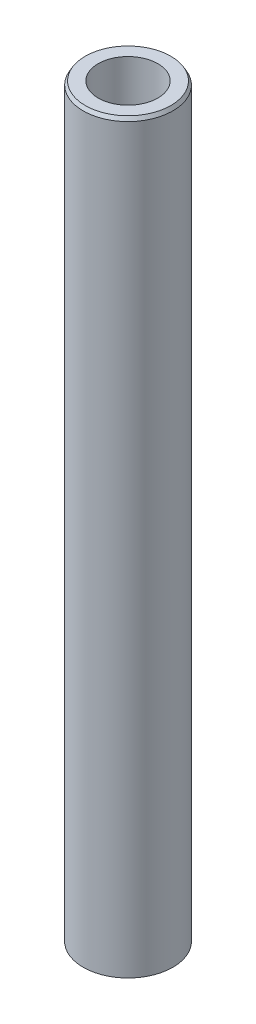
ISO-10303-21;
HEADER;
FILE_DESCRIPTION(('STEP AP214'),'2;1');
FILE_NAME('part.step','',(''),(''),'','','');
FILE_SCHEMA(('AUTOMOTIVE_DESIGN { 1 0 10303 214 1 1 1 1 }'));
ENDSEC;
DATA;
#1=APPLICATION_CONTEXT('core data for automotive mechanical design processes');
#2=APPLICATION_PROTOCOL_DEFINITION('international standard','automotive_design',2000,#1);
#3=PRODUCT_CONTEXT('',#1,'mechanical');
#4=PRODUCT('Part','Part','',(#3));
#5=PRODUCT_RELATED_PRODUCT_CATEGORY('part','',(#4));
#6=PRODUCT_DEFINITION_FORMATION('','',#4);
#7=PRODUCT_DEFINITION_CONTEXT('part definition',#1,'design');
#8=PRODUCT_DEFINITION('design','',#6,#7);
#9=PRODUCT_DEFINITION_SHAPE('','',#8);
#10=(LENGTH_UNIT() NAMED_UNIT(*) SI_UNIT(.MILLI.,.METRE.));
#11=(NAMED_UNIT(*) PLANE_ANGLE_UNIT() SI_UNIT($,.RADIAN.));
#12=(NAMED_UNIT(*) SI_UNIT($,.STERADIAN.) SOLID_ANGLE_UNIT());
#13=UNCERTAINTY_MEASURE_WITH_UNIT(LENGTH_MEASURE(1.E-05),#10,'distance_accuracy_value','');
#14=(GEOMETRIC_REPRESENTATION_CONTEXT(3) GLOBAL_UNCERTAINTY_ASSIGNED_CONTEXT((#13)) GLOBAL_UNIT_ASSIGNED_CONTEXT((#10,
#11,#12)) REPRESENTATION_CONTEXT('',''));
#15=CARTESIAN_POINT('',(0.,0.,0.));
#16=DIRECTION('',(0.,0.,1.));
#17=DIRECTION('',(1.,0.,0.));
#18=AXIS2_PLACEMENT_3D('',#15,#16,#17);
#19=CARTESIAN_POINT('',(0.,499.981358572789,0.));
#20=DIRECTION('',(0.,-1.,0.));
#21=DIRECTION('',(0.,0.,-1.));
#22=AXIS2_PLACEMENT_3D('',#19,#20,#21);
#23=CYLINDRICAL_SURFACE('',#22,30.);
#24=CARTESIAN_POINT('',(0.,497.579931080547,0.));
#25=DIRECTION('',(0.,1.,0.));
#26=DIRECTION('',(0.,0.,1.));
#27=AXIS2_PLACEMENT_3D('',#24,#25,#26);
#28=CIRCLE('',#27,30.);
#29=CARTESIAN_POINT('',(0.,497.579931080547,-30.));
#30=VERTEX_POINT('',#29);
#31=EDGE_CURVE('E50',#30,#30,#28,.F.);
#32=CARTESIAN_POINT('',(0.,1.38646480908561,0.));
#33=DIRECTION('',(0.,1.,0.));
#34=DIRECTION('',(0.,0.,1.));
#35=AXIS2_PLACEMENT_3D('',#32,#33,#34);
#36=CIRCLE('',#35,30.);
#37=CARTESIAN_POINT('',(0.,1.38646480908561,-30.));
#38=VERTEX_POINT('',#37);
#39=EDGE_CURVE('E51',#38,#38,#36,.T.);
#40=CARTESIAN_POINT('',(0.,497.579931080547,-30.));
#41=CARTESIAN_POINT('',(0.,492.411249140219,-30.));
#42=CARTESIAN_POINT('',(0.,487.242567199891,-30.));
#43=CARTESIAN_POINT('',(0.,476.905203319236,-30.));
#44=CARTESIAN_POINT('',(0.,471.736521378908,-30.));
#45=CARTESIAN_POINT('',(0.,461.399157498253,-30.));
#46=CARTESIAN_POINT('',(0.,456.230475557925,-30.));
#47=CARTESIAN_POINT('',(0.,445.89311167727,-30.));
#48=CARTESIAN_POINT('',(0.,440.724429736942,-30.));
#49=CARTESIAN_POINT('',(0.,430.387065856287,-30.));
#50=CARTESIAN_POINT('',(0.,425.218383915959,-30.));
#51=CARTESIAN_POINT('',(0.,414.881020035303,-30.));
#52=CARTESIAN_POINT('',(0.,409.712338094976,-30.));
#53=CARTESIAN_POINT('',(0.,399.37497421432,-30.));
#54=CARTESIAN_POINT('',(0.,394.206292273993,-30.));
#55=CARTESIAN_POINT('',(0.,383.868928393337,-30.));
#56=CARTESIAN_POINT('',(0.,378.700246453009,-30.));
#57=CARTESIAN_POINT('',(0.,368.362882572354,-30.));
#58=CARTESIAN_POINT('',(0.,363.194200632026,-30.));
#59=CARTESIAN_POINT('',(0.,352.856836751371,-30.));
#60=CARTESIAN_POINT('',(0.,347.688154811043,-30.));
#61=CARTESIAN_POINT('',(0.,337.350790930388,-30.));
#62=CARTESIAN_POINT('',(0.,332.18210899006,-30.));
#63=CARTESIAN_POINT('',(0.,321.844745109404,-30.));
#64=CARTESIAN_POINT('',(0.,316.676063169077,-30.));
#65=CARTESIAN_POINT('',(0.,306.338699288421,-30.));
#66=CARTESIAN_POINT('',(0.,301.170017348093,-30.));
#67=CARTESIAN_POINT('',(0.,290.832653467438,-30.));
#68=CARTESIAN_POINT('',(0.,285.66397152711,-30.));
#69=CARTESIAN_POINT('',(0.,275.326607646455,-30.));
#70=CARTESIAN_POINT('',(0.,270.157925706127,-30.));
#71=CARTESIAN_POINT('',(0.,259.820561825472,-30.));
#72=CARTESIAN_POINT('',(0.,254.651879885144,-30.));
#73=CARTESIAN_POINT('',(0.,244.314516004489,-30.));
#74=CARTESIAN_POINT('',(0.,239.145834064161,-30.));
#75=CARTESIAN_POINT('',(0.,228.808470183505,-30.));
#76=CARTESIAN_POINT('',(0.,223.639788243178,-30.));
#77=CARTESIAN_POINT('',(0.,213.302424362522,-30.));
#78=CARTESIAN_POINT('',(0.,208.133742422195,-30.));
#79=CARTESIAN_POINT('',(0.,197.796378541539,-30.));
#80=CARTESIAN_POINT('',(0.,192.627696601211,-30.));
#81=CARTESIAN_POINT('',(0.,182.290332720556,-30.));
#82=CARTESIAN_POINT('',(0.,177.121650780228,-30.));
#83=CARTESIAN_POINT('',(0.,166.784286899573,-30.));
#84=CARTESIAN_POINT('',(0.,161.615604959245,-30.));
#85=CARTESIAN_POINT('',(0.,151.27824107859,-30.));
#86=CARTESIAN_POINT('',(0.,146.109559138262,-30.));
#87=CARTESIAN_POINT('',(0.,135.772195257606,-30.));
#88=CARTESIAN_POINT('',(0.,130.603513317279,-30.));
#89=CARTESIAN_POINT('',(0.,120.266149436623,-30.));
#90=CARTESIAN_POINT('',(0.,115.097467496296,-30.));
#91=CARTESIAN_POINT('',(0.,104.76010361564,-30.));
#92=CARTESIAN_POINT('',(0.,99.5914216753123,-30.));
#93=CARTESIAN_POINT('',(0.,89.2540577946569,-30.));
#94=CARTESIAN_POINT('',(0.,84.0853758543292,-30.));
#95=CARTESIAN_POINT('',(0.,73.7480119736737,-30.));
#96=CARTESIAN_POINT('',(0.,68.579330033346,-30.));
#97=CARTESIAN_POINT('',(0.,58.2419661526906,-30.));
#98=CARTESIAN_POINT('',(0.,53.0732842123629,-30.));
#99=CARTESIAN_POINT('',(0.,42.7359203317074,-30.));
#100=CARTESIAN_POINT('',(0.,37.5672383913797,-30.));
#101=CARTESIAN_POINT('',(0.,27.2298745107242,-30.));
#102=CARTESIAN_POINT('',(0.,22.0611925703965,-30.));
#103=CARTESIAN_POINT('',(0.,11.7238286897411,-30.));
#104=CARTESIAN_POINT('',(0.,6.55514674941333,-30.));
#105=CARTESIAN_POINT('',(0.,1.38646480908561,-30.));
#106=B_SPLINE_CURVE_WITH_KNOTS('',3,(#40,#41,#42,#43,#44,#45,#46,#47,#48,#49,#50,#51,#52,#53,
#54,#55,#56,#57,#58,#59,#60,#61,#62,#63,#64,#65,#66,#67,#68,#69,#70,#71,#72,#73,#74,#75,#76,#77,
#78,#79,#80,#81,#82,#83,#84,#85,#86,#87,#88,#89,#90,#91,#92,#93,#94,#95,#96,#97,#98,#99,#100,
#101,#102,#103,#104,#105),.UNSPECIFIED.,.F.,.F.,(4,2,2,2,2,2,2,2,2,2,2,2,2,2,2,2,2,2,2,2,2,2,2,
2,2,2,2,2,2,2,2,2,4),(0.,15.5060458209831,31.0120916419663,46.5181374629495,62.0241832839326,
77.5302291049158,93.036274925899,108.542320746882,124.048366567865,139.554412388848,
155.060458209832,170.566504030815,186.072549851798,201.578595672781,217.084641493764,
232.590687314747,248.096733135731,263.602778956714,279.108824777697,294.61487059868,
310.120916419663,325.626962240646,341.13300806163,356.639053882613,372.145099703596,
387.651145524579,403.157191345562,418.663237166545,434.169282987529,449.675328808512,
465.181374629495,480.687420450478,496.193466271461),.UNSPECIFIED.);
#107=EDGE_CURVE('BSEAM39',#30,#38,#106,.T.);
#108=ORIENTED_EDGE('',*,*,#31,.T.);
#109=ORIENTED_EDGE('',*,*,#39,.T.);
#110=ORIENTED_EDGE('',*,*,#107,.T.);
#111=ORIENTED_EDGE('',*,*,#107,.F.);
#112=EDGE_LOOP('',(#108,#110,#109,#111));
#113=FACE_BOUND('',#112,.T.);
#114=ADVANCED_FACE('F39',(#113),#23,.T.);
#115=CARTESIAN_POINT('',(0.,499.981358572789,0.));
#116=DIRECTION('',(0.,1.,0.));
#117=DIRECTION('',(0.,0.,1.));
#118=AXIS2_PLACEMENT_3D('',#115,#116,#117);
#119=PLANE('',#118);
#120=CARTESIAN_POINT('',(0.,499.981358572789,0.));
#121=DIRECTION('',(0.,1.,0.));
#122=DIRECTION('',(0.,0.,1.));
#123=AXIS2_PLACEMENT_3D('',#120,#121,#122);
#124=CIRCLE('',#123,28.6135351909147);
#125=CARTESIAN_POINT('',(0.,499.981358572789,28.6135351909147));
#126=VERTEX_POINT('',#125);
#127=EDGE_CURVE('E54',#126,#126,#124,.T.);
#128=ORIENTED_EDGE('',*,*,#127,.T.);
#129=EDGE_LOOP('',(#128));
#130=FACE_BOUND('',#129,.T.);
#131=CARTESIAN_POINT('',(0.,499.981358572789,0.));
#132=DIRECTION('',(0.,1.,0.));
#133=DIRECTION('',(0.,0.,1.));
#134=AXIS2_PLACEMENT_3D('',#131,#132,#133);
#135=CIRCLE('',#134,19.9570828072295);
#136=CARTESIAN_POINT('',(0.,499.981358572789,-19.9570828072295));
#137=VERTEX_POINT('',#136);
#138=EDGE_CURVE('E58',#137,#137,#135,.T.);
#139=ORIENTED_EDGE('',*,*,#138,.F.);
#140=EDGE_LOOP('',(#139));
#141=FACE_BOUND('',#140,.T.);
#142=ADVANCED_FACE('F69',(#130,#141),#119,.T.);
#143=CARTESIAN_POINT('',(0.,0.,0.));
#144=DIRECTION('',(0.,1.,0.));
#145=DIRECTION('',(0.,0.,1.));
#146=AXIS2_PLACEMENT_3D('',#143,#144,#145);
#147=PLANE('',#146);
#148=CARTESIAN_POINT('',(0.,0.,0.));
#149=DIRECTION('',(0.,1.,0.));
#150=DIRECTION('',(0.,0.,1.));
#151=AXIS2_PLACEMENT_3D('',#148,#149,#150);
#152=CIRCLE('',#151,27.5985725077575);
#153=CARTESIAN_POINT('',(0.,0.,27.5985725077575));
#154=VERTEX_POINT('',#153);
#155=EDGE_CURVE('E10',#154,#154,#152,.F.);
#156=ORIENTED_EDGE('',*,*,#155,.T.);
#157=EDGE_LOOP('',(#156));
#158=FACE_BOUND('',#157,.T.);
#159=CARTESIAN_POINT('',(0.,0.,0.));
#160=DIRECTION('',(0.,1.,0.));
#161=DIRECTION('',(0.,0.,1.));
#162=AXIS2_PLACEMENT_3D('',#159,#160,#161);
#163=CIRCLE('',#162,19.9570828072295);
#164=CARTESIAN_POINT('',(0.,0.,-19.9570828072295));
#165=VERTEX_POINT('',#164);
#166=EDGE_CURVE('E63',#165,#165,#163,.T.);
#167=ORIENTED_EDGE('',*,*,#166,.T.);
#168=EDGE_LOOP('',(#167));
#169=FACE_BOUND('',#168,.T.);
#170=ADVANCED_FACE('F75',(#158,#169),#147,.F.);
#171=CARTESIAN_POINT('',(0.,499.981358572789,0.));
#172=DIRECTION('',(0.,-1.,0.));
#173=DIRECTION('',(0.,0.,-1.));
#174=AXIS2_PLACEMENT_3D('',#171,#172,#173);
#175=CYLINDRICAL_SURFACE('',#174,19.9570828072295);
#176=CARTESIAN_POINT('',(0.,499.981358572789,-19.9570828072295));
#177=CARTESIAN_POINT('',(0.,494.773219420989,-19.9570828072295));
#178=CARTESIAN_POINT('',(0.,489.565080269189,-19.9570828072295));
#179=CARTESIAN_POINT('',(0.,479.148801965589,-19.9570828072295));
#180=CARTESIAN_POINT('',(0.,473.94066281379,-19.9570828072295));
#181=CARTESIAN_POINT('',(0.,463.52438451019,-19.9570828072295));
#182=CARTESIAN_POINT('',(0.,458.31624535839,-19.9570828072295));
#183=CARTESIAN_POINT('',(0.,447.89996705479,-19.9570828072295));
#184=CARTESIAN_POINT('',(0.,442.69182790299,-19.9570828072295));
#185=CARTESIAN_POINT('',(0.,432.27554959939,-19.9570828072295));
#186=CARTESIAN_POINT('',(0.,427.06741044759,-19.9570828072295));
#187=CARTESIAN_POINT('',(0.,416.651132143991,-19.9570828072295));
#188=CARTESIAN_POINT('',(0.,411.442992992191,-19.9570828072295));
#189=CARTESIAN_POINT('',(0.,401.026714688591,-19.9570828072295));
#190=CARTESIAN_POINT('',(0.,395.818575536791,-19.9570828072295));
#191=CARTESIAN_POINT('',(0.,385.402297233191,-19.9570828072295));
#192=CARTESIAN_POINT('',(0.,380.194158081392,-19.9570828072295));
#193=CARTESIAN_POINT('',(0.,369.777879777792,-19.9570828072295));
#194=CARTESIAN_POINT('',(0.,364.569740625992,-19.9570828072295));
#195=CARTESIAN_POINT('',(0.,354.153462322392,-19.9570828072295));
#196=CARTESIAN_POINT('',(0.,348.945323170592,-19.9570828072295));
#197=CARTESIAN_POINT('',(0.,338.529044866992,-19.9570828072295));
#198=CARTESIAN_POINT('',(0.,333.320905715193,-19.9570828072295));
#199=CARTESIAN_POINT('',(0.,322.904627411593,-19.9570828072295));
#200=CARTESIAN_POINT('',(0.,317.696488259793,-19.9570828072295));
#201=CARTESIAN_POINT('',(0.,307.280209956193,-19.9570828072295));
#202=CARTESIAN_POINT('',(0.,302.072070804393,-19.9570828072295));
#203=CARTESIAN_POINT('',(0.,291.655792500793,-19.9570828072295));
#204=CARTESIAN_POINT('',(0.,286.447653348994,-19.9570828072295));
#205=CARTESIAN_POINT('',(0.,276.031375045394,-19.9570828072295));
#206=CARTESIAN_POINT('',(0.,270.823235893594,-19.9570828072295));
#207=CARTESIAN_POINT('',(0.,260.406957589994,-19.9570828072295));
#208=CARTESIAN_POINT('',(0.,255.198818438194,-19.9570828072295));
#209=CARTESIAN_POINT('',(0.,244.782540134595,-19.9570828072295));
#210=CARTESIAN_POINT('',(0.,239.574400982795,-19.9570828072295));
#211=CARTESIAN_POINT('',(0.,229.158122679195,-19.9570828072295));
#212=CARTESIAN_POINT('',(0.,223.949983527395,-19.9570828072295));
#213=CARTESIAN_POINT('',(0.,213.533705223795,-19.9570828072295));
#214=CARTESIAN_POINT('',(0.,208.325566071995,-19.9570828072295));
#215=CARTESIAN_POINT('',(0.,197.909287768396,-19.9570828072295));
#216=CARTESIAN_POINT('',(0.,192.701148616596,-19.9570828072295));
#217=CARTESIAN_POINT('',(0.,182.284870312996,-19.9570828072295));
#218=CARTESIAN_POINT('',(0.,177.076731161196,-19.9570828072295));
#219=CARTESIAN_POINT('',(0.,166.660452857596,-19.9570828072295));
#220=CARTESIAN_POINT('',(0.,161.452313705796,-19.9570828072295));
#221=CARTESIAN_POINT('',(0.,151.036035402197,-19.9570828072295));
#222=CARTESIAN_POINT('',(0.,145.827896250397,-19.9570828072295));
#223=CARTESIAN_POINT('',(0.,135.411617946797,-19.9570828072295));
#224=CARTESIAN_POINT('',(0.,130.203478794997,-19.9570828072295));
#225=CARTESIAN_POINT('',(0.,119.787200491397,-19.9570828072295));
#226=CARTESIAN_POINT('',(0.,114.579061339597,-19.9570828072295));
#227=CARTESIAN_POINT('',(0.,104.162783035998,-19.9570828072295));
#228=CARTESIAN_POINT('',(0.,98.9546438841978,-19.9570828072295));
#229=CARTESIAN_POINT('',(0.,88.538365580598,-19.9570828072295));
#230=CARTESIAN_POINT('',(0.,83.3302264287981,-19.9570828072295));
#231=CARTESIAN_POINT('',(0.,72.9139481251983,-19.9570828072295));
#232=CARTESIAN_POINT('',(0.,67.7058089733984,-19.9570828072295));
#233=CARTESIAN_POINT('',(0.,57.2895306697987,-19.9570828072295));
#234=CARTESIAN_POINT('',(0.,52.0813915179988,-19.9570828072295));
#235=CARTESIAN_POINT('',(0.,41.665113214399,-19.9570828072295));
#236=CARTESIAN_POINT('',(0.,36.4569740625992,-19.9570828072295));
#237=CARTESIAN_POINT('',(0.,26.0406957589994,-19.9570828072295));
#238=CARTESIAN_POINT('',(0.,20.8325566071995,-19.9570828072295));
#239=CARTESIAN_POINT('',(0.,10.4162783035997,-19.9570828072295));
#240=CARTESIAN_POINT('',(0.,5.20813915179983,-19.9570828072295));
#241=CARTESIAN_POINT('',(0.,0.,-19.9570828072295));
#242=B_SPLINE_CURVE_WITH_KNOTS('',3,(#176,#177,#178,#179,#180,#181,#182,#183,#184,#185,#186,
#187,#188,#189,#190,#191,#192,#193,#194,#195,#196,#197,#198,#199,#200,#201,#202,#203,#204,#205,
#206,#207,#208,#209,#210,#211,#212,#213,#214,#215,#216,#217,#218,#219,#220,#221,#222,#223,#224,
#225,#226,#227,#228,#229,#230,#231,#232,#233,#234,#235,#236,#237,#238,#239,#240,#241),
.UNSPECIFIED.,.F.,.F.,(4,2,2,2,2,2,2,2,2,2,2,2,2,2,2,2,2,2,2,2,2,2,2,2,2,2,2,2,2,2,2,2,4),(0.,
15.6244174553996,31.2488349107993,46.8732523661989,62.4976698215986,78.1220872769983,
93.7465047323979,109.370922187798,124.995339643197,140.619757098597,156.244174553996,
171.868592009396,187.493009464796,203.117426920195,218.741844375595,234.366261830995,
249.990679286394,265.615096741794,281.239514197194,296.863931652593,312.488349107993,
328.112766563393,343.737184018792,359.361601474192,374.986018929592,390.610436384991,
406.234853840391,421.859271295791,437.48368875119,453.10810620659,468.73252366199,
484.356941117389,499.981358572789),.UNSPECIFIED.);
#243=EDGE_CURVE('BSEAM70',#137,#165,#242,.T.);
#244=ORIENTED_EDGE('',*,*,#138,.T.);
#245=ORIENTED_EDGE('',*,*,#166,.F.);
#246=ORIENTED_EDGE('',*,*,#243,.T.);
#247=ORIENTED_EDGE('',*,*,#243,.F.);
#248=EDGE_LOOP('',(#244,#246,#245,#247));
#249=FACE_BOUND('',#248,.T.);
#250=ADVANCED_FACE('F70',(#249),#175,.F.);
#251=CARTESIAN_POINT('',(0.,499.981358572789,0.));
#252=DIRECTION('',(0.,-1.,0.));
#253=DIRECTION('',(0.,0.,-1.));
#254=AXIS2_PLACEMENT_3D('',#251,#252,#253);
#255=CONICAL_SURFACE('',#254,28.6135351909147,0.523598775598301);
#256=ORIENTED_EDGE('',*,*,#31,.F.);
#257=EDGE_LOOP('',(#256));
#258=FACE_BOUND('',#257,.T.);
#259=ORIENTED_EDGE('',*,*,#127,.F.);
#260=EDGE_LOOP('',(#259));
#261=FACE_BOUND('',#260,.T.);
#262=ADVANCED_FACE('F81',(#258,#261),#255,.T.);
#263=CARTESIAN_POINT('',(0.,1.38646480908561,0.));
#264=DIRECTION('',(0.,1.,0.));
#265=DIRECTION('',(0.,0.,1.));
#266=AXIS2_PLACEMENT_3D('',#263,#264,#265);
#267=CONICAL_SURFACE('',#266,30.,1.04719755119659);
#268=ORIENTED_EDGE('',*,*,#155,.F.);
#269=EDGE_LOOP('',(#268));
#270=FACE_BOUND('',#269,.T.);
#271=ORIENTED_EDGE('',*,*,#39,.F.);
#272=EDGE_LOOP('',(#271));
#273=FACE_BOUND('',#272,.T.);
#274=ADVANCED_FACE('F45',(#270,#273),#267,.T.);
#275=CLOSED_SHELL('',(#114,#142,#170,#250,#262,#274));
#276=MANIFOLD_SOLID_BREP('B2',#275);
#277=ADVANCED_BREP_SHAPE_REPRESENTATION('',(#18,#276),#14);
#278=SHAPE_DEFINITION_REPRESENTATION(#9,#277);
ENDSEC;
END-ISO-10303-21;
